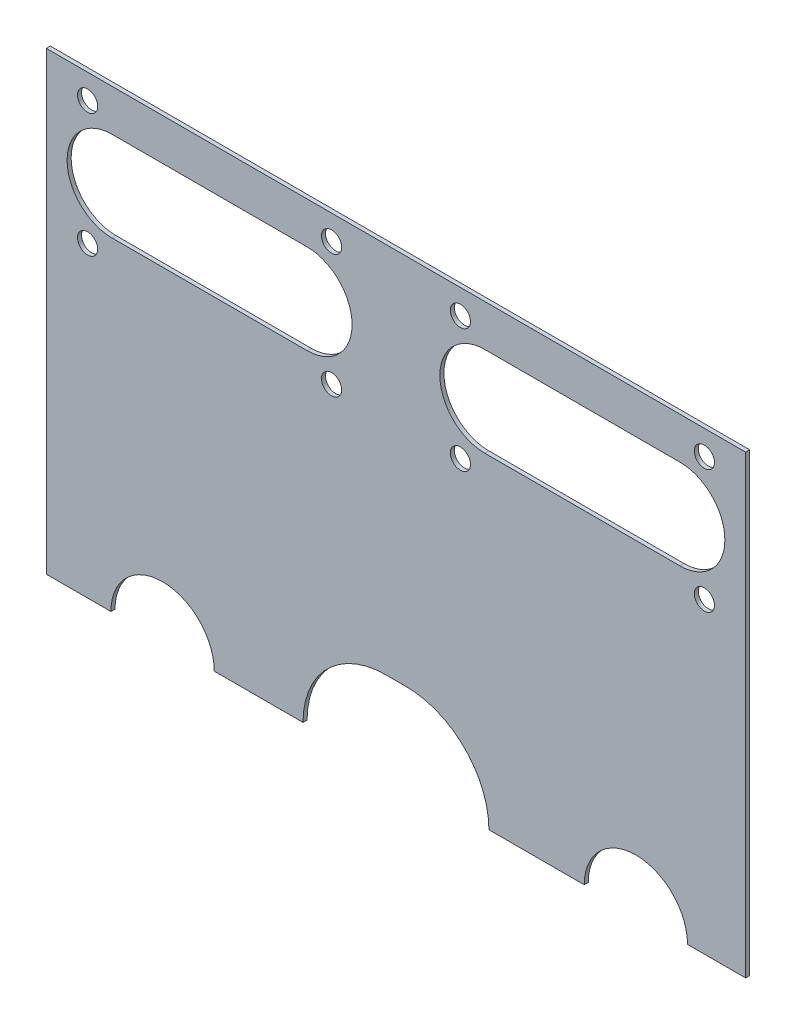
ISO-10303-21;
HEADER;
FILE_DESCRIPTION(('STEP AP214'),'2;1');
FILE_NAME('part.step','',(''),(''),'','','');
FILE_SCHEMA(('AUTOMOTIVE_DESIGN { 1 0 10303 214 1 1 1 1 }'));
ENDSEC;
DATA;
#1=APPLICATION_CONTEXT('core data for automotive mechanical design processes');
#2=APPLICATION_PROTOCOL_DEFINITION('international standard','automotive_design',2000,#1);
#3=PRODUCT_CONTEXT('',#1,'mechanical');
#4=PRODUCT('Part','Part','',(#3));
#5=PRODUCT_RELATED_PRODUCT_CATEGORY('part','',(#4));
#6=PRODUCT_DEFINITION_FORMATION('','',#4);
#7=PRODUCT_DEFINITION_CONTEXT('part definition',#1,'design');
#8=PRODUCT_DEFINITION('design','',#6,#7);
#9=PRODUCT_DEFINITION_SHAPE('','',#8);
#10=(LENGTH_UNIT() NAMED_UNIT(*) SI_UNIT(.MILLI.,.METRE.));
#11=(NAMED_UNIT(*) PLANE_ANGLE_UNIT() SI_UNIT($,.RADIAN.));
#12=(NAMED_UNIT(*) SI_UNIT($,.STERADIAN.) SOLID_ANGLE_UNIT());
#13=UNCERTAINTY_MEASURE_WITH_UNIT(LENGTH_MEASURE(1.E-05),#10,'distance_accuracy_value','');
#14=(GEOMETRIC_REPRESENTATION_CONTEXT(3) GLOBAL_UNCERTAINTY_ASSIGNED_CONTEXT((#13)) GLOBAL_UNIT_ASSIGNED_CONTEXT((#10,
#11,#12)) REPRESENTATION_CONTEXT('',''));
#15=CARTESIAN_POINT('',(0.,0.,0.));
#16=DIRECTION('',(0.,0.,1.));
#17=DIRECTION('',(1.,0.,0.));
#18=AXIS2_PLACEMENT_3D('',#15,#16,#17);
#19=CARTESIAN_POINT('',(0.,110.19565512848,-213.060100000002));
#20=DIRECTION('',(0.,0.,-1.));
#21=DIRECTION('',(0.,1.,0.));
#22=AXIS2_PLACEMENT_3D('',#19,#20,#21);
#23=PLANE('',#22);
#24=DIRECTION('',(0.,-1.,0.));
#25=VECTOR('',#24,1.);
#26=CARTESIAN_POINT('',(-107.499999999999,324.500355128482,-213.060100000001));
#27=LINE('',#26,#25);
#28=CARTESIAN_POINT('',(-107.499999999999,387.634255128482,-213.0601));
#29=VERTEX_POINT('',#28);
#30=CARTESIAN_POINT('',(-107.499999999999,247.639,-213.060100000001));
#31=VERTEX_POINT('',#30);
#32=EDGE_CURVE('E189',#29,#31,#27,.T.);
#33=ORIENTED_EDGE('',*,*,#32,.T.);
#34=DIRECTION('',(-1.,0.,0.));
#35=VECTOR('',#34,1.);
#36=CARTESIAN_POINT('',(-87.6224999999988,247.639,-213.060100000001));
#37=LINE('',#36,#35);
#38=CARTESIAN_POINT('',(-87.6224999999988,247.639,-213.060100000001));
#39=VERTEX_POINT('',#38);
#40=EDGE_CURVE('E393',#39,#31,#37,.T.);
#41=ORIENTED_EDGE('',*,*,#40,.F.);
#42=CARTESIAN_POINT('',(-71.7474999999988,247.639,-213.060100000001));
#43=DIRECTION('',(0.,0.,1.));
#44=DIRECTION('',(1.,0.,0.));
#45=AXIS2_PLACEMENT_3D('',#42,#43,#44);
#46=CIRCLE('',#45,15.875);
#47=CARTESIAN_POINT('',(-55.8724999999988,247.639,-213.060100000001));
#48=VERTEX_POINT('',#47);
#49=EDGE_CURVE('E398',#48,#39,#46,.T.);
#50=ORIENTED_EDGE('',*,*,#49,.F.);
#51=DIRECTION('',(-1.,0.,0.));
#52=VECTOR('',#51,1.);
#53=CARTESIAN_POINT('',(-28.5749999999993,247.639,-213.060100000001));
#54=LINE('',#53,#52);
#55=CARTESIAN_POINT('',(-28.5749999999993,247.639,-213.060100000001));
#56=VERTEX_POINT('',#55);
#57=EDGE_CURVE('E404',#56,#48,#54,.T.);
#58=ORIENTED_EDGE('',*,*,#57,.F.);
#59=CARTESIAN_POINT('',(-3.17499999999928,247.639,-213.060100000001));
#60=DIRECTION('',(0.,0.,1.));
#61=DIRECTION('',(-1.,0.,0.));
#62=AXIS2_PLACEMENT_3D('',#59,#60,#61);
#63=CIRCLE('',#62,25.4);
#64=CARTESIAN_POINT('',(-3.17499999999928,273.039,-213.060100000001));
#65=VERTEX_POINT('',#64);
#66=EDGE_CURVE('E409',#65,#56,#63,.T.);
#67=ORIENTED_EDGE('',*,*,#66,.F.);
#68=DIRECTION('',(-1.,0.,0.));
#69=VECTOR('',#68,1.);
#70=CARTESIAN_POINT('',(3.17500000000072,273.039,-213.060100000001));
#71=LINE('',#70,#69);
#72=CARTESIAN_POINT('',(3.17500000000072,273.039,-213.060100000001));
#73=VERTEX_POINT('',#72);
#74=EDGE_CURVE('E414',#73,#65,#71,.T.);
#75=ORIENTED_EDGE('',*,*,#74,.F.);
#76=CARTESIAN_POINT('',(3.17500000000072,247.639,-213.060100000001));
#77=DIRECTION('',(0.,0.,1.));
#78=DIRECTION('',(1.,0.,0.));
#79=AXIS2_PLACEMENT_3D('',#76,#77,#78);
#80=CIRCLE('',#79,25.4);
#81=CARTESIAN_POINT('',(28.5750000000007,247.639,-213.060100000001));
#82=VERTEX_POINT('',#81);
#83=EDGE_CURVE('E419',#82,#73,#80,.T.);
#84=ORIENTED_EDGE('',*,*,#83,.F.);
#85=DIRECTION('',(-1.,0.,0.));
#86=VECTOR('',#85,1.);
#87=CARTESIAN_POINT('',(57.877500000001,247.639,-213.0601));
#88=LINE('',#87,#86);
#89=CARTESIAN_POINT('',(57.877500000001,247.639,-213.0601));
#90=VERTEX_POINT('',#89);
#91=EDGE_CURVE('E424',#90,#82,#88,.T.);
#92=ORIENTED_EDGE('',*,*,#91,.F.);
#93=CARTESIAN_POINT('',(73.752500000001,247.639,-213.0601));
#94=DIRECTION('',(0.,0.,1.));
#95=DIRECTION('',(1.,0.,0.));
#96=AXIS2_PLACEMENT_3D('',#93,#94,#95);
#97=CIRCLE('',#96,15.875);
#98=CARTESIAN_POINT('',(89.627500000001,247.639,-213.0601));
#99=VERTEX_POINT('',#98);
#100=EDGE_CURVE('E203',#99,#90,#97,.T.);
#101=ORIENTED_EDGE('',*,*,#100,.F.);
#102=DIRECTION('',(-1.,0.,0.));
#103=VECTOR('',#102,1.);
#104=CARTESIAN_POINT('',(107.500000000001,247.639,-213.0601));
#105=LINE('',#104,#103);
#106=CARTESIAN_POINT('',(107.500000000001,247.639,-213.0601));
#107=VERTEX_POINT('',#106);
#108=EDGE_CURVE('E194',#107,#99,#105,.T.);
#109=ORIENTED_EDGE('',*,*,#108,.F.);
#110=DIRECTION('',(0.,1.,0.));
#111=VECTOR('',#110,1.);
#112=CARTESIAN_POINT('',(107.500000000001,387.634255128482,-213.0601));
#113=LINE('',#112,#111);
#114=CARTESIAN_POINT('',(107.500000000001,387.634255128482,-213.0601));
#115=VERTEX_POINT('',#114);
#116=EDGE_CURVE('E180',#107,#115,#113,.T.);
#117=ORIENTED_EDGE('',*,*,#116,.T.);
#118=DIRECTION('',(-1.,0.,0.));
#119=VECTOR('',#118,1.);
#120=CARTESIAN_POINT('',(-107.499999999999,387.634255128482,-213.0601));
#121=LINE('',#120,#119);
#122=EDGE_CURVE('E188',#115,#29,#121,.T.);
#123=ORIENTED_EDGE('',*,*,#122,.T.);
#124=EDGE_LOOP('',(#33,#41,#50,#58,#67,#75,#84,#92,#101,#109,#117,#123));
#125=FACE_BOUND('',#124,.T.);
#126=CARTESIAN_POINT('',(94.8000000000008,342.058755128482,-213.0601));
#127=DIRECTION('',(0.,0.,1.));
#128=DIRECTION('',(0.,-1.,0.));
#129=AXIS2_PLACEMENT_3D('',#126,#127,#128);
#130=CIRCLE('',#129,3.1);
#131=CARTESIAN_POINT('',(94.8000000000008,338.958755128482,-213.060100000001));
#132=VERTEX_POINT('',#131);
#133=EDGE_CURVE('E338',#132,#132,#130,.T.);
#134=ORIENTED_EDGE('',*,*,#133,.F.);
#135=EDGE_LOOP('',(#134));
#136=FACE_BOUND('',#135,.T.);
#137=CARTESIAN_POINT('',(19.8000000000008,342.058755128482,-213.0601));
#138=DIRECTION('',(0.,0.,1.));
#139=DIRECTION('',(0.,-1.,0.));
#140=AXIS2_PLACEMENT_3D('',#137,#138,#139);
#141=CIRCLE('',#140,3.09999999999998);
#142=CARTESIAN_POINT('',(19.8000000000008,338.958755128482,-213.0601));
#143=VERTEX_POINT('',#142);
#144=EDGE_CURVE('E331',#143,#143,#141,.T.);
#145=ORIENTED_EDGE('',*,*,#144,.F.);
#146=EDGE_LOOP('',(#145));
#147=FACE_BOUND('',#146,.T.);
#148=CARTESIAN_POINT('',(19.8000000000008,380.058755128482,-213.0601));
#149=DIRECTION('',(0.,0.,1.));
#150=DIRECTION('',(0.,-1.,0.));
#151=AXIS2_PLACEMENT_3D('',#148,#149,#150);
#152=CIRCLE('',#151,3.09999999999998);
#153=CARTESIAN_POINT('',(19.8000000000008,376.958755128482,-213.0601));
#154=VERTEX_POINT('',#153);
#155=EDGE_CURVE('E324',#154,#154,#152,.T.);
#156=ORIENTED_EDGE('',*,*,#155,.F.);
#157=EDGE_LOOP('',(#156));
#158=FACE_BOUND('',#157,.T.);
#159=CARTESIAN_POINT('',(94.8000000000008,380.058755128482,-213.0601));
#160=DIRECTION('',(0.,0.,1.));
#161=DIRECTION('',(0.,-1.,0.));
#162=AXIS2_PLACEMENT_3D('',#159,#160,#161);
#163=CIRCLE('',#162,3.1);
#164=CARTESIAN_POINT('',(94.8000000000008,376.958755128482,-213.0601));
#165=VERTEX_POINT('',#164);
#166=EDGE_CURVE('E317',#165,#165,#163,.T.);
#167=ORIENTED_EDGE('',*,*,#166,.F.);
#168=EDGE_LOOP('',(#167));
#169=FACE_BOUND('',#168,.T.);
#170=DIRECTION('',(-1.,0.,0.));
#171=VECTOR('',#170,1.);
#172=CARTESIAN_POINT('',(87.3000000000008,374.858755128482,-213.0601));
#173=LINE('',#172,#171);
#174=CARTESIAN_POINT('',(87.3000000000008,374.858755128482,-213.0601));
#175=VERTEX_POINT('',#174);
#176=CARTESIAN_POINT('',(27.3000000000008,374.858755128482,-213.0601));
#177=VERTEX_POINT('',#176);
#178=EDGE_CURVE('E288',#175,#177,#173,.T.);
#179=ORIENTED_EDGE('',*,*,#178,.F.);
#180=CARTESIAN_POINT('',(87.3000000000008,361.058755128482,-213.0601));
#181=DIRECTION('',(0.,0.,1.));
#182=DIRECTION('',(0.,-1.,0.));
#183=AXIS2_PLACEMENT_3D('',#180,#181,#182);
#184=CIRCLE('',#183,13.8);
#185=CARTESIAN_POINT('',(87.3000000000008,347.258755128482,-213.0601));
#186=VERTEX_POINT('',#185);
#187=EDGE_CURVE('E285',#186,#175,#184,.T.);
#188=ORIENTED_EDGE('',*,*,#187,.F.);
#189=DIRECTION('',(1.,0.,0.));
#190=VECTOR('',#189,1.);
#191=CARTESIAN_POINT('',(87.3000000000008,347.258755128482,-213.0601));
#192=LINE('',#191,#190);
#193=CARTESIAN_POINT('',(27.3000000000008,347.258755128482,-213.0601));
#194=VERTEX_POINT('',#193);
#195=EDGE_CURVE('E296',#194,#186,#192,.T.);
#196=ORIENTED_EDGE('',*,*,#195,.F.);
#197=CARTESIAN_POINT('',(27.3000000000008,361.058755128482,-213.0601));
#198=DIRECTION('',(0.,0.,1.));
#199=DIRECTION('',(0.,-1.,0.));
#200=AXIS2_PLACEMENT_3D('',#197,#198,#199);
#201=CIRCLE('',#200,13.8);
#202=EDGE_CURVE('E292',#177,#194,#201,.T.);
#203=ORIENTED_EDGE('',*,*,#202,.F.);
#204=EDGE_LOOP('',(#179,#188,#196,#203));
#205=FACE_BOUND('',#204,.T.);
#206=CARTESIAN_POINT('',(-94.8000000000008,342.058755128482,-213.0601));
#207=DIRECTION('',(0.,0.,-1.));
#208=DIRECTION('',(0.,-1.,0.));
#209=AXIS2_PLACEMENT_3D('',#206,#207,#208);
#210=CIRCLE('',#209,3.1);
#211=CARTESIAN_POINT('',(-94.8000000000008,338.958755128482,-213.0601));
#212=VERTEX_POINT('',#211);
#213=EDGE_CURVE('E267',#212,#212,#210,.T.);
#214=ORIENTED_EDGE('',*,*,#213,.T.);
#215=EDGE_LOOP('',(#214));
#216=FACE_BOUND('',#215,.T.);
#217=CARTESIAN_POINT('',(-19.8000000000008,342.058755128482,-213.0601));
#218=DIRECTION('',(0.,0.,-1.));
#219=DIRECTION('',(0.,-1.,0.));
#220=AXIS2_PLACEMENT_3D('',#217,#218,#219);
#221=CIRCLE('',#220,3.09999999999998);
#222=CARTESIAN_POINT('',(-19.8000000000008,338.958755128482,-213.060100000001));
#223=VERTEX_POINT('',#222);
#224=EDGE_CURVE('E260',#223,#223,#221,.T.);
#225=ORIENTED_EDGE('',*,*,#224,.T.);
#226=EDGE_LOOP('',(#225));
#227=FACE_BOUND('',#226,.T.);
#228=CARTESIAN_POINT('',(-19.8000000000008,380.058755128482,-213.0601));
#229=DIRECTION('',(0.,0.,-1.));
#230=DIRECTION('',(0.,-1.,0.));
#231=AXIS2_PLACEMENT_3D('',#228,#229,#230);
#232=CIRCLE('',#231,3.09999999999998);
#233=CARTESIAN_POINT('',(-19.8000000000008,376.958755128482,-213.0601));
#234=VERTEX_POINT('',#233);
#235=EDGE_CURVE('E253',#234,#234,#232,.T.);
#236=ORIENTED_EDGE('',*,*,#235,.T.);
#237=EDGE_LOOP('',(#236));
#238=FACE_BOUND('',#237,.T.);
#239=CARTESIAN_POINT('',(-94.8000000000008,380.058755128482,-213.0601));
#240=DIRECTION('',(0.,0.,-1.));
#241=DIRECTION('',(0.,-1.,0.));
#242=AXIS2_PLACEMENT_3D('',#239,#240,#241);
#243=CIRCLE('',#242,3.1);
#244=CARTESIAN_POINT('',(-94.8000000000008,376.958755128482,-213.0601));
#245=VERTEX_POINT('',#244);
#246=EDGE_CURVE('E245',#245,#245,#243,.T.);
#247=ORIENTED_EDGE('',*,*,#246,.T.);
#248=EDGE_LOOP('',(#247));
#249=FACE_BOUND('',#248,.T.);
#250=CARTESIAN_POINT('',(-87.3000000000008,361.058755128482,-213.0601));
#251=DIRECTION('',(0.,0.,-1.));
#252=DIRECTION('',(0.,-1.,0.));
#253=AXIS2_PLACEMENT_3D('',#250,#251,#252);
#254=CIRCLE('',#253,13.8);
#255=CARTESIAN_POINT('',(-87.3000000000008,347.258755128482,-213.060100000001));
#256=VERTEX_POINT('',#255);
#257=CARTESIAN_POINT('',(-87.3000000000008,374.858755128482,-213.0601));
#258=VERTEX_POINT('',#257);
#259=EDGE_CURVE('E58',#256,#258,#254,.T.);
#260=ORIENTED_EDGE('',*,*,#259,.T.);
#261=DIRECTION('',(1.,0.,0.));
#262=VECTOR('',#261,1.);
#263=CARTESIAN_POINT('',(-87.3000000000008,374.858755128482,-213.0601));
#264=LINE('',#263,#262);
#265=CARTESIAN_POINT('',(-27.3000000000008,374.858755128482,-213.0601));
#266=VERTEX_POINT('',#265);
#267=EDGE_CURVE('E227',#258,#266,#264,.T.);
#268=ORIENTED_EDGE('',*,*,#267,.T.);
#269=CARTESIAN_POINT('',(-27.3000000000008,361.058755128482,-213.0601));
#270=DIRECTION('',(0.,0.,-1.));
#271=DIRECTION('',(0.,-1.,0.));
#272=AXIS2_PLACEMENT_3D('',#269,#270,#271);
#273=CIRCLE('',#272,13.8);
#274=CARTESIAN_POINT('',(-27.3000000000008,347.258755128482,-213.0601));
#275=VERTEX_POINT('',#274);
#276=EDGE_CURVE('E223',#266,#275,#273,.T.);
#277=ORIENTED_EDGE('',*,*,#276,.T.);
#278=DIRECTION('',(-1.,0.,0.));
#279=VECTOR('',#278,1.);
#280=CARTESIAN_POINT('',(-87.3000000000008,347.258755128482,-213.0601));
#281=LINE('',#280,#279);
#282=EDGE_CURVE('E220',#275,#256,#281,.T.);
#283=ORIENTED_EDGE('',*,*,#282,.T.);
#284=EDGE_LOOP('',(#260,#268,#277,#283));
#285=FACE_BOUND('',#284,.T.);
#286=ADVANCED_FACE('F43',(#125,#136,#147,#158,#169,#205,#216,#227,#238,#249,#285),#23,.F.);
#287=CARTESIAN_POINT('',(-71.7474999999988,247.639,-214.304700000001));
#288=DIRECTION('',(0.,0.,1.));
#289=DIRECTION('',(1.,0.,0.));
#290=AXIS2_PLACEMENT_3D('',#287,#288,#289);
#291=PLANE('',#290);
#292=CARTESIAN_POINT('',(-94.8000000000008,380.058755128482,-214.3047));
#293=DIRECTION('',(0.,0.,-1.));
#294=DIRECTION('',(0.,1.,0.));
#295=AXIS2_PLACEMENT_3D('',#292,#293,#294);
#296=CIRCLE('',#295,3.1);
#297=CARTESIAN_POINT('',(-94.8000000000008,383.158755128482,-214.3047));
#298=VERTEX_POINT('',#297);
#299=EDGE_CURVE('E249',#298,#298,#296,.T.);
#300=ORIENTED_EDGE('',*,*,#299,.F.);
#301=EDGE_LOOP('',(#300));
#302=FACE_BOUND('',#301,.T.);
#303=CARTESIAN_POINT('',(-19.8000000000008,380.058755128482,-214.3047));
#304=DIRECTION('',(0.,0.,-1.));
#305=DIRECTION('',(0.,1.,0.));
#306=AXIS2_PLACEMENT_3D('',#303,#304,#305);
#307=CIRCLE('',#306,3.09999999999998);
#308=CARTESIAN_POINT('',(-19.8000000000008,383.158755128482,-214.3047));
#309=VERTEX_POINT('',#308);
#310=EDGE_CURVE('E257',#309,#309,#307,.T.);
#311=ORIENTED_EDGE('',*,*,#310,.F.);
#312=EDGE_LOOP('',(#311));
#313=FACE_BOUND('',#312,.T.);
#314=CARTESIAN_POINT('',(-19.8000000000008,342.058755128482,-214.304700000001));
#315=DIRECTION('',(0.,0.,-1.));
#316=DIRECTION('',(0.,1.,0.));
#317=AXIS2_PLACEMENT_3D('',#314,#315,#316);
#318=CIRCLE('',#317,3.09999999999998);
#319=CARTESIAN_POINT('',(-19.8000000000008,345.158755128482,-214.304700000001));
#320=VERTEX_POINT('',#319);
#321=EDGE_CURVE('E264',#320,#320,#318,.T.);
#322=ORIENTED_EDGE('',*,*,#321,.F.);
#323=EDGE_LOOP('',(#322));
#324=FACE_BOUND('',#323,.T.);
#325=CARTESIAN_POINT('',(-94.8000000000008,342.058755128482,-214.304700000001));
#326=DIRECTION('',(0.,0.,-1.));
#327=DIRECTION('',(0.,1.,0.));
#328=AXIS2_PLACEMENT_3D('',#325,#326,#327);
#329=CIRCLE('',#328,3.1);
#330=CARTESIAN_POINT('',(-94.8000000000008,345.158755128482,-214.3047));
#331=VERTEX_POINT('',#330);
#332=EDGE_CURVE('E271',#331,#331,#329,.T.);
#333=ORIENTED_EDGE('',*,*,#332,.F.);
#334=EDGE_LOOP('',(#333));
#335=FACE_BOUND('',#334,.T.);
#336=CARTESIAN_POINT('',(87.3000000000008,361.058755128482,-214.3047));
#337=DIRECTION('',(0.,0.,-1.));
#338=DIRECTION('',(0.,1.,0.));
#339=AXIS2_PLACEMENT_3D('',#336,#337,#338);
#340=CIRCLE('',#339,13.8);
#341=CARTESIAN_POINT('',(87.3000000000008,347.258755128482,-214.304700000001));
#342=VERTEX_POINT('',#341);
#343=CARTESIAN_POINT('',(87.3000000000008,374.858755128482,-214.3047));
#344=VERTEX_POINT('',#343);
#345=EDGE_CURVE('E281',#342,#344,#340,.F.);
#346=ORIENTED_EDGE('',*,*,#345,.T.);
#347=DIRECTION('',(-1.,0.,0.));
#348=VECTOR('',#347,1.);
#349=CARTESIAN_POINT('',(87.3000000000008,374.858755128482,-214.3047));
#350=LINE('',#349,#348);
#351=CARTESIAN_POINT('',(27.3000000000008,374.858755128482,-214.3047));
#352=VERTEX_POINT('',#351);
#353=EDGE_CURVE('E304',#344,#352,#350,.T.);
#354=ORIENTED_EDGE('',*,*,#353,.T.);
#355=CARTESIAN_POINT('',(27.3000000000008,361.058755128482,-214.3047));
#356=DIRECTION('',(0.,0.,-1.));
#357=DIRECTION('',(0.,1.,0.));
#358=AXIS2_PLACEMENT_3D('',#355,#356,#357);
#359=CIRCLE('',#358,13.8);
#360=CARTESIAN_POINT('',(27.3000000000008,347.258755128482,-214.304700000001));
#361=VERTEX_POINT('',#360);
#362=EDGE_CURVE('E274',#352,#361,#359,.F.);
#363=ORIENTED_EDGE('',*,*,#362,.T.);
#364=DIRECTION('',(1.,0.,0.));
#365=VECTOR('',#364,1.);
#366=CARTESIAN_POINT('',(87.3000000000008,347.258755128482,-214.304700000001));
#367=LINE('',#366,#365);
#368=EDGE_CURVE('E278',#361,#342,#367,.T.);
#369=ORIENTED_EDGE('',*,*,#368,.T.);
#370=EDGE_LOOP('',(#346,#354,#363,#369));
#371=FACE_BOUND('',#370,.T.);
#372=CARTESIAN_POINT('',(94.8000000000008,380.058755128482,-214.3047));
#373=DIRECTION('',(0.,0.,-1.));
#374=DIRECTION('',(0.,1.,0.));
#375=AXIS2_PLACEMENT_3D('',#372,#373,#374);
#376=CIRCLE('',#375,3.1);
#377=CARTESIAN_POINT('',(94.8000000000008,383.158755128482,-214.3047));
#378=VERTEX_POINT('',#377);
#379=EDGE_CURVE('E316',#378,#378,#376,.F.);
#380=ORIENTED_EDGE('',*,*,#379,.T.);
#381=EDGE_LOOP('',(#380));
#382=FACE_BOUND('',#381,.T.);
#383=CARTESIAN_POINT('',(19.8000000000008,380.058755128482,-214.3047));
#384=DIRECTION('',(0.,0.,-1.));
#385=DIRECTION('',(0.,1.,0.));
#386=AXIS2_PLACEMENT_3D('',#383,#384,#385);
#387=CIRCLE('',#386,3.09999999999998);
#388=CARTESIAN_POINT('',(19.8000000000008,383.158755128482,-214.3047));
#389=VERTEX_POINT('',#388);
#390=EDGE_CURVE('E321',#389,#389,#387,.F.);
#391=ORIENTED_EDGE('',*,*,#390,.T.);
#392=EDGE_LOOP('',(#391));
#393=FACE_BOUND('',#392,.T.);
#394=CARTESIAN_POINT('',(19.8000000000008,342.058755128482,-214.304700000001));
#395=DIRECTION('',(0.,0.,-1.));
#396=DIRECTION('',(0.,1.,0.));
#397=AXIS2_PLACEMENT_3D('',#394,#395,#396);
#398=CIRCLE('',#397,3.09999999999998);
#399=CARTESIAN_POINT('',(19.8000000000008,345.158755128482,-214.3047));
#400=VERTEX_POINT('',#399);
#401=EDGE_CURVE('E328',#400,#400,#398,.F.);
#402=ORIENTED_EDGE('',*,*,#401,.T.);
#403=EDGE_LOOP('',(#402));
#404=FACE_BOUND('',#403,.T.);
#405=CARTESIAN_POINT('',(94.8000000000008,342.058755128482,-214.304700000001));
#406=DIRECTION('',(0.,0.,-1.));
#407=DIRECTION('',(0.,1.,0.));
#408=AXIS2_PLACEMENT_3D('',#405,#406,#407);
#409=CIRCLE('',#408,3.1);
#410=CARTESIAN_POINT('',(94.8000000000008,345.158755128482,-214.304700000001));
#411=VERTEX_POINT('',#410);
#412=EDGE_CURVE('E335',#411,#411,#409,.F.);
#413=ORIENTED_EDGE('',*,*,#412,.T.);
#414=EDGE_LOOP('',(#413));
#415=FACE_BOUND('',#414,.T.);
#416=DIRECTION('',(0.,1.,0.));
#417=VECTOR('',#416,1.);
#418=CARTESIAN_POINT('',(107.500000000001,387.634255128482,-214.3047));
#419=LINE('',#418,#417);
#420=CARTESIAN_POINT('',(107.500000000001,247.639,-214.3047));
#421=VERTEX_POINT('',#420);
#422=CARTESIAN_POINT('',(107.500000000001,387.634255128482,-214.3047));
#423=VERTEX_POINT('',#422);
#424=EDGE_CURVE('E349',#421,#423,#419,.T.);
#425=ORIENTED_EDGE('',*,*,#424,.F.);
#426=DIRECTION('',(-1.,0.,0.));
#427=VECTOR('',#426,1.);
#428=CARTESIAN_POINT('',(107.500000000001,247.639,-214.3047));
#429=LINE('',#428,#427);
#430=CARTESIAN_POINT('',(89.627500000001,247.639,-214.3047));
#431=VERTEX_POINT('',#430);
#432=EDGE_CURVE('E196',#421,#431,#429,.T.);
#433=ORIENTED_EDGE('',*,*,#432,.T.);
#434=CARTESIAN_POINT('',(73.752500000001,247.639,-214.3047));
#435=DIRECTION('',(0.,0.,1.));
#436=DIRECTION('',(1.,0.,0.));
#437=AXIS2_PLACEMENT_3D('',#434,#435,#436);
#438=CIRCLE('',#437,15.875);
#439=CARTESIAN_POINT('',(57.877500000001,247.639,-214.3047));
#440=VERTEX_POINT('',#439);
#441=EDGE_CURVE('E387',#431,#440,#438,.T.);
#442=ORIENTED_EDGE('',*,*,#441,.T.);
#443=DIRECTION('',(-1.,0.,0.));
#444=VECTOR('',#443,1.);
#445=CARTESIAN_POINT('',(57.877500000001,247.639,-214.3047));
#446=LINE('',#445,#444);
#447=CARTESIAN_POINT('',(28.5750000000007,247.639,-214.304700000001));
#448=VERTEX_POINT('',#447);
#449=EDGE_CURVE('E384',#440,#448,#446,.T.);
#450=ORIENTED_EDGE('',*,*,#449,.T.);
#451=CARTESIAN_POINT('',(3.17500000000072,247.639,-214.304700000001));
#452=DIRECTION('',(0.,0.,1.));
#453=DIRECTION('',(1.,0.,0.));
#454=AXIS2_PLACEMENT_3D('',#451,#452,#453);
#455=CIRCLE('',#454,25.4);
#456=CARTESIAN_POINT('',(3.17500000000072,273.039,-214.304700000001));
#457=VERTEX_POINT('',#456);
#458=EDGE_CURVE('E381',#448,#457,#455,.T.);
#459=ORIENTED_EDGE('',*,*,#458,.T.);
#460=DIRECTION('',(-1.,0.,0.));
#461=VECTOR('',#460,1.);
#462=CARTESIAN_POINT('',(3.17500000000072,273.039,-214.304700000001));
#463=LINE('',#462,#461);
#464=CARTESIAN_POINT('',(-3.17499999999928,273.039,-214.304700000001));
#465=VERTEX_POINT('',#464);
#466=EDGE_CURVE('E378',#457,#465,#463,.T.);
#467=ORIENTED_EDGE('',*,*,#466,.T.);
#468=CARTESIAN_POINT('',(-3.17499999999928,247.639,-214.304700000001));
#469=DIRECTION('',(0.,0.,1.));
#470=DIRECTION('',(-1.,0.,0.));
#471=AXIS2_PLACEMENT_3D('',#468,#469,#470);
#472=CIRCLE('',#471,25.4);
#473=CARTESIAN_POINT('',(-28.5749999999993,247.639,-214.304700000001));
#474=VERTEX_POINT('',#473);
#475=EDGE_CURVE('E375',#465,#474,#472,.T.);
#476=ORIENTED_EDGE('',*,*,#475,.T.);
#477=DIRECTION('',(-1.,0.,0.));
#478=VECTOR('',#477,1.);
#479=CARTESIAN_POINT('',(-28.5749999999993,247.639,-214.304700000001));
#480=LINE('',#479,#478);
#481=CARTESIAN_POINT('',(-55.8724999999988,247.639,-214.304700000001));
#482=VERTEX_POINT('',#481);
#483=EDGE_CURVE('E371',#474,#482,#480,.T.);
#484=ORIENTED_EDGE('',*,*,#483,.T.);
#485=CARTESIAN_POINT('',(-71.7474999999988,247.639,-214.304700000001));
#486=DIRECTION('',(0.,0.,1.));
#487=DIRECTION('',(1.,0.,0.));
#488=AXIS2_PLACEMENT_3D('',#485,#486,#487);
#489=CIRCLE('',#488,15.875);
#490=CARTESIAN_POINT('',(-87.6224999999988,247.639,-214.304700000001));
#491=VERTEX_POINT('',#490);
#492=EDGE_CURVE('E368',#482,#491,#489,.T.);
#493=ORIENTED_EDGE('',*,*,#492,.T.);
#494=DIRECTION('',(-1.,0.,0.));
#495=VECTOR('',#494,1.);
#496=CARTESIAN_POINT('',(-87.6224999999988,247.639,-214.304700000001));
#497=LINE('',#496,#495);
#498=CARTESIAN_POINT('',(-107.499999999999,247.639,-214.304700000001));
#499=VERTEX_POINT('',#498);
#500=EDGE_CURVE('E197',#491,#499,#497,.T.);
#501=ORIENTED_EDGE('',*,*,#500,.T.);
#502=DIRECTION('',(0.,-1.,0.));
#503=VECTOR('',#502,1.);
#504=CARTESIAN_POINT('',(-107.499999999999,324.500355128482,-214.304700000001));
#505=LINE('',#504,#503);
#506=CARTESIAN_POINT('',(-107.499999999999,387.634255128482,-214.3047));
#507=VERTEX_POINT('',#506);
#508=EDGE_CURVE('E342',#507,#499,#505,.T.);
#509=ORIENTED_EDGE('',*,*,#508,.F.);
#510=DIRECTION('',(-1.,0.,0.));
#511=VECTOR('',#510,1.);
#512=CARTESIAN_POINT('',(-107.499999999999,387.634255128482,-214.3047));
#513=LINE('',#512,#511);
#514=EDGE_CURVE('E345',#423,#507,#513,.T.);
#515=ORIENTED_EDGE('',*,*,#514,.F.);
#516=EDGE_LOOP('',(#425,#433,#442,#450,#459,#467,#476,#484,#493,#501,#509,#515));
#517=FACE_BOUND('',#516,.T.);
#518=DIRECTION('',(1.,0.,0.));
#519=VECTOR('',#518,1.);
#520=CARTESIAN_POINT('',(-87.3000000000008,374.858755128482,-214.3047));
#521=LINE('',#520,#519);
#522=CARTESIAN_POINT('',(-87.3000000000008,374.858755128482,-214.3047));
#523=VERTEX_POINT('',#522);
#524=CARTESIAN_POINT('',(-27.3000000000008,374.858755128482,-214.3047));
#525=VERTEX_POINT('',#524);
#526=EDGE_CURVE('E211',#523,#525,#521,.T.);
#527=ORIENTED_EDGE('',*,*,#526,.F.);
#528=CARTESIAN_POINT('',(-87.3000000000008,361.058755128482,-214.3047));
#529=DIRECTION('',(0.,0.,-1.));
#530=DIRECTION('',(0.,1.,0.));
#531=AXIS2_PLACEMENT_3D('',#528,#529,#530);
#532=CIRCLE('',#531,13.8);
#533=CARTESIAN_POINT('',(-87.3000000000008,347.258755128482,-214.304700000001));
#534=VERTEX_POINT('',#533);
#535=EDGE_CURVE('E214',#534,#523,#532,.T.);
#536=ORIENTED_EDGE('',*,*,#535,.F.);
#537=DIRECTION('',(-1.,0.,0.));
#538=VECTOR('',#537,1.);
#539=CARTESIAN_POINT('',(-87.3000000000008,347.258755128482,-214.304700000001));
#540=LINE('',#539,#538);
#541=CARTESIAN_POINT('',(-27.3000000000008,347.258755128482,-214.304700000001));
#542=VERTEX_POINT('',#541);
#543=EDGE_CURVE('E234',#542,#534,#540,.T.);
#544=ORIENTED_EDGE('',*,*,#543,.F.);
#545=CARTESIAN_POINT('',(-27.3000000000008,361.058755128482,-214.3047));
#546=DIRECTION('',(0.,0.,-1.));
#547=DIRECTION('',(0.,1.,0.));
#548=AXIS2_PLACEMENT_3D('',#545,#546,#547);
#549=CIRCLE('',#548,13.8);
#550=EDGE_CURVE('E66',#525,#542,#549,.T.);
#551=ORIENTED_EDGE('',*,*,#550,.F.);
#552=EDGE_LOOP('',(#527,#536,#544,#551));
#553=FACE_BOUND('',#552,.T.);
#554=ADVANCED_FACE('F45',(#302,#313,#324,#335,#371,#382,#393,#404,#415,#517,#553),#291,.F.);
#555=CARTESIAN_POINT('',(-107.499999999999,324.500355128482,-213.060100000001));
#556=DIRECTION('',(1.,0.,0.));
#557=DIRECTION('',(0.,1.,0.));
#558=AXIS2_PLACEMENT_3D('',#555,#556,#557);
#559=PLANE('',#558);
#560=ORIENTED_EDGE('',*,*,#508,.T.);
#561=DIRECTION('',(0.,0.,-1.));
#562=VECTOR('',#561,1.);
#563=CARTESIAN_POINT('',(-107.499999999999,247.639,-213.060100000001));
#564=LINE('',#563,#562);
#565=EDGE_CURVE('E391',#31,#499,#564,.T.);
#566=ORIENTED_EDGE('',*,*,#565,.F.);
#567=ORIENTED_EDGE('',*,*,#32,.F.);
#568=DIRECTION('',(0.,0.,-1.));
#569=VECTOR('',#568,1.);
#570=CARTESIAN_POINT('',(-107.499999999999,387.634255128482,-213.0601));
#571=LINE('',#570,#569);
#572=EDGE_CURVE('E51',#29,#507,#571,.T.);
#573=ORIENTED_EDGE('',*,*,#572,.T.);
#574=EDGE_LOOP('',(#560,#566,#567,#573));
#575=FACE_BOUND('',#574,.T.);
#576=ADVANCED_FACE('F356',(#575),#559,.F.);
#577=CARTESIAN_POINT('',(107.500000000001,387.634255128482,-213.0601));
#578=DIRECTION('',(-1.,0.,0.));
#579=DIRECTION('',(0.,-1.,0.));
#580=AXIS2_PLACEMENT_3D('',#577,#578,#579);
#581=PLANE('',#580);
#582=ORIENTED_EDGE('',*,*,#116,.F.);
#583=DIRECTION('',(0.,0.,-1.));
#584=VECTOR('',#583,1.);
#585=CARTESIAN_POINT('',(107.500000000001,247.639,-213.0601));
#586=LINE('',#585,#584);
#587=EDGE_CURVE('E183',#107,#421,#586,.T.);
#588=ORIENTED_EDGE('',*,*,#587,.T.);
#589=ORIENTED_EDGE('',*,*,#424,.T.);
#590=DIRECTION('',(0.,0.,-1.));
#591=VECTOR('',#590,1.);
#592=CARTESIAN_POINT('',(107.500000000001,387.634255128482,-213.0601));
#593=LINE('',#592,#591);
#594=EDGE_CURVE('E11',#115,#423,#593,.T.);
#595=ORIENTED_EDGE('',*,*,#594,.F.);
#596=EDGE_LOOP('',(#582,#588,#589,#595));
#597=FACE_BOUND('',#596,.T.);
#598=ADVANCED_FACE('F182',(#597),#581,.F.);
#599=CARTESIAN_POINT('',(-107.499999999999,387.634255128482,-213.0601));
#600=DIRECTION('',(0.,-1.,0.));
#601=DIRECTION('',(0.,0.,-1.));
#602=AXIS2_PLACEMENT_3D('',#599,#600,#601);
#603=PLANE('',#602);
#604=ORIENTED_EDGE('',*,*,#514,.T.);
#605=ORIENTED_EDGE('',*,*,#572,.F.);
#606=ORIENTED_EDGE('',*,*,#122,.F.);
#607=ORIENTED_EDGE('',*,*,#594,.T.);
#608=EDGE_LOOP('',(#604,#605,#606,#607));
#609=FACE_BOUND('',#608,.T.);
#610=ADVANCED_FACE('F432',(#609),#603,.F.);
#611=CARTESIAN_POINT('',(94.8000000000008,342.058755128485,-551.696700000001));
#612=DIRECTION('',(0.,0.,1.));
#613=DIRECTION('',(0.,-1.,0.));
#614=AXIS2_PLACEMENT_3D('',#611,#612,#613);
#615=CYLINDRICAL_SURFACE('',#614,3.1);
#616=ORIENTED_EDGE('',*,*,#412,.F.);
#617=EDGE_LOOP('',(#616));
#618=FACE_BOUND('',#617,.T.);
#619=ORIENTED_EDGE('',*,*,#133,.T.);
#620=EDGE_LOOP('',(#619));
#621=FACE_BOUND('',#620,.T.);
#622=ADVANCED_FACE('F472',(#618,#621),#615,.F.);
#623=CARTESIAN_POINT('',(19.8000000000008,342.058755128485,-551.696700000001));
#624=DIRECTION('',(0.,0.,1.));
#625=DIRECTION('',(0.,-1.,0.));
#626=AXIS2_PLACEMENT_3D('',#623,#624,#625);
#627=CYLINDRICAL_SURFACE('',#626,3.09999999999998);
#628=ORIENTED_EDGE('',*,*,#401,.F.);
#629=EDGE_LOOP('',(#628));
#630=FACE_BOUND('',#629,.T.);
#631=ORIENTED_EDGE('',*,*,#144,.T.);
#632=EDGE_LOOP('',(#631));
#633=FACE_BOUND('',#632,.T.);
#634=ADVANCED_FACE('F500',(#630,#633),#627,.F.);
#635=CARTESIAN_POINT('',(19.8000000000008,380.058755128485,-551.696700000001));
#636=DIRECTION('',(0.,0.,1.));
#637=DIRECTION('',(0.,-1.,0.));
#638=AXIS2_PLACEMENT_3D('',#635,#636,#637);
#639=CYLINDRICAL_SURFACE('',#638,3.09999999999998);
#640=ORIENTED_EDGE('',*,*,#390,.F.);
#641=EDGE_LOOP('',(#640));
#642=FACE_BOUND('',#641,.T.);
#643=ORIENTED_EDGE('',*,*,#155,.T.);
#644=EDGE_LOOP('',(#643));
#645=FACE_BOUND('',#644,.T.);
#646=ADVANCED_FACE('F508',(#642,#645),#639,.F.);
#647=CARTESIAN_POINT('',(94.8000000000008,380.058755128485,-551.696700000001));
#648=DIRECTION('',(0.,0.,1.));
#649=DIRECTION('',(0.,-1.,0.));
#650=AXIS2_PLACEMENT_3D('',#647,#648,#649);
#651=CYLINDRICAL_SURFACE('',#650,3.1);
#652=ORIENTED_EDGE('',*,*,#379,.F.);
#653=EDGE_LOOP('',(#652));
#654=FACE_BOUND('',#653,.T.);
#655=ORIENTED_EDGE('',*,*,#166,.T.);
#656=EDGE_LOOP('',(#655));
#657=FACE_BOUND('',#656,.T.);
#658=ADVANCED_FACE('F516',(#654,#657),#651,.F.);
#659=CARTESIAN_POINT('',(87.3000000000008,361.058755128485,-551.696700000001));
#660=DIRECTION('',(0.,0.,1.));
#661=DIRECTION('',(0.,-1.,0.));
#662=AXIS2_PLACEMENT_3D('',#659,#660,#661);
#663=CYLINDRICAL_SURFACE('',#662,13.8);
#664=DIRECTION('',(0.,0.,1.));
#665=VECTOR('',#664,1.);
#666=CARTESIAN_POINT('',(87.3000000000008,347.258755128485,-551.696700000001));
#667=LINE('',#666,#665);
#668=EDGE_CURVE('E301',#342,#186,#667,.T.);
#669=ORIENTED_EDGE('',*,*,#668,.T.);
#670=ORIENTED_EDGE('',*,*,#187,.T.);
#671=DIRECTION('',(0.,0.,1.));
#672=VECTOR('',#671,1.);
#673=CARTESIAN_POINT('',(87.3000000000008,374.858755128485,-551.696700000001));
#674=LINE('',#673,#672);
#675=EDGE_CURVE('E300',#344,#175,#674,.T.);
#676=ORIENTED_EDGE('',*,*,#675,.F.);
#677=ORIENTED_EDGE('',*,*,#345,.F.);
#678=EDGE_LOOP('',(#669,#670,#676,#677));
#679=FACE_BOUND('',#678,.T.);
#680=ADVANCED_FACE('F525',(#679),#663,.F.);
#681=CARTESIAN_POINT('',(87.3000000000008,347.258755128485,-551.696700000001));
#682=DIRECTION('',(0.,-1.,0.));
#683=DIRECTION('',(0.,0.,-1.));
#684=AXIS2_PLACEMENT_3D('',#681,#682,#683);
#685=PLANE('',#684);
#686=DIRECTION('',(0.,0.,1.));
#687=VECTOR('',#686,1.);
#688=CARTESIAN_POINT('',(27.3000000000008,347.258755128485,-551.696700000001));
#689=LINE('',#688,#687);
#690=EDGE_CURVE('E305',#361,#194,#689,.T.);
#691=ORIENTED_EDGE('',*,*,#690,.T.);
#692=ORIENTED_EDGE('',*,*,#195,.T.);
#693=ORIENTED_EDGE('',*,*,#668,.F.);
#694=ORIENTED_EDGE('',*,*,#368,.F.);
#695=EDGE_LOOP('',(#691,#692,#693,#694));
#696=FACE_BOUND('',#695,.T.);
#697=ADVANCED_FACE('F535',(#696),#685,.F.);
#698=CARTESIAN_POINT('',(27.3000000000008,361.058755128485,-551.696700000001));
#699=DIRECTION('',(0.,0.,1.));
#700=DIRECTION('',(0.,-1.,0.));
#701=AXIS2_PLACEMENT_3D('',#698,#699,#700);
#702=CYLINDRICAL_SURFACE('',#701,13.8);
#703=DIRECTION('',(0.,0.,1.));
#704=VECTOR('',#703,1.);
#705=CARTESIAN_POINT('',(27.3000000000008,374.858755128485,-551.696700000001));
#706=LINE('',#705,#704);
#707=EDGE_CURVE('E308',#352,#177,#706,.T.);
#708=ORIENTED_EDGE('',*,*,#707,.T.);
#709=ORIENTED_EDGE('',*,*,#202,.T.);
#710=ORIENTED_EDGE('',*,*,#690,.F.);
#711=ORIENTED_EDGE('',*,*,#362,.F.);
#712=EDGE_LOOP('',(#708,#709,#710,#711));
#713=FACE_BOUND('',#712,.T.);
#714=ADVANCED_FACE('F543',(#713),#702,.F.);
#715=CARTESIAN_POINT('',(87.3000000000008,374.858755128485,-551.696700000001));
#716=DIRECTION('',(0.,1.,0.));
#717=DIRECTION('',(0.,0.,1.));
#718=AXIS2_PLACEMENT_3D('',#715,#716,#717);
#719=PLANE('',#718);
#720=ORIENTED_EDGE('',*,*,#675,.T.);
#721=ORIENTED_EDGE('',*,*,#178,.T.);
#722=ORIENTED_EDGE('',*,*,#707,.F.);
#723=ORIENTED_EDGE('',*,*,#353,.F.);
#724=EDGE_LOOP('',(#720,#721,#722,#723));
#725=FACE_BOUND('',#724,.T.);
#726=ADVANCED_FACE('F552',(#725),#719,.F.);
#727=CARTESIAN_POINT('',(-94.8000000000008,342.058755128483,-290.505700000001));
#728=DIRECTION('',(0.,0.,1.));
#729=DIRECTION('',(0.,-1.,0.));
#730=AXIS2_PLACEMENT_3D('',#727,#728,#729);
#731=CYLINDRICAL_SURFACE('',#730,3.1);
#732=ORIENTED_EDGE('',*,*,#332,.T.);
#733=EDGE_LOOP('',(#732));
#734=FACE_BOUND('',#733,.T.);
#735=ORIENTED_EDGE('',*,*,#213,.F.);
#736=EDGE_LOOP('',(#735));
#737=FACE_BOUND('',#736,.T.);
#738=ADVANCED_FACE('F560',(#734,#737),#731,.F.);
#739=CARTESIAN_POINT('',(-19.8000000000008,342.058755128483,-290.505700000001));
#740=DIRECTION('',(0.,0.,1.));
#741=DIRECTION('',(0.,-1.,0.));
#742=AXIS2_PLACEMENT_3D('',#739,#740,#741);
#743=CYLINDRICAL_SURFACE('',#742,3.09999999999998);
#744=ORIENTED_EDGE('',*,*,#321,.T.);
#745=EDGE_LOOP('',(#744));
#746=FACE_BOUND('',#745,.T.);
#747=ORIENTED_EDGE('',*,*,#224,.F.);
#748=EDGE_LOOP('',(#747));
#749=FACE_BOUND('',#748,.T.);
#750=ADVANCED_FACE('F568',(#746,#749),#743,.F.);
#751=CARTESIAN_POINT('',(-19.8000000000008,380.058755128483,-290.505700000001));
#752=DIRECTION('',(0.,0.,1.));
#753=DIRECTION('',(0.,-1.,0.));
#754=AXIS2_PLACEMENT_3D('',#751,#752,#753);
#755=CYLINDRICAL_SURFACE('',#754,3.09999999999998);
#756=ORIENTED_EDGE('',*,*,#310,.T.);
#757=EDGE_LOOP('',(#756));
#758=FACE_BOUND('',#757,.T.);
#759=ORIENTED_EDGE('',*,*,#235,.F.);
#760=EDGE_LOOP('',(#759));
#761=FACE_BOUND('',#760,.T.);
#762=ADVANCED_FACE('F577',(#758,#761),#755,.F.);
#763=CARTESIAN_POINT('',(-94.8000000000008,380.058755128483,-290.505700000001));
#764=DIRECTION('',(0.,0.,1.));
#765=DIRECTION('',(0.,-1.,0.));
#766=AXIS2_PLACEMENT_3D('',#763,#764,#765);
#767=CYLINDRICAL_SURFACE('',#766,3.1);
#768=ORIENTED_EDGE('',*,*,#299,.T.);
#769=EDGE_LOOP('',(#768));
#770=FACE_BOUND('',#769,.T.);
#771=ORIENTED_EDGE('',*,*,#246,.F.);
#772=EDGE_LOOP('',(#771));
#773=FACE_BOUND('',#772,.T.);
#774=ADVANCED_FACE('F586',(#770,#773),#767,.F.);
#775=CARTESIAN_POINT('',(-87.3000000000008,361.058755128483,-290.505700000001));
#776=DIRECTION('',(0.,0.,1.));
#777=DIRECTION('',(0.,-1.,0.));
#778=AXIS2_PLACEMENT_3D('',#775,#776,#777);
#779=CYLINDRICAL_SURFACE('',#778,13.8);
#780=ORIENTED_EDGE('',*,*,#535,.T.);
#781=DIRECTION('',(0.,0.,1.));
#782=VECTOR('',#781,1.);
#783=CARTESIAN_POINT('',(-87.3000000000008,374.858755128483,-290.505700000001));
#784=LINE('',#783,#782);
#785=EDGE_CURVE('E231',#523,#258,#784,.T.);
#786=ORIENTED_EDGE('',*,*,#785,.T.);
#787=ORIENTED_EDGE('',*,*,#259,.F.);
#788=DIRECTION('',(0.,0.,1.));
#789=VECTOR('',#788,1.);
#790=CARTESIAN_POINT('',(-87.3000000000008,347.258755128483,-290.505700000001));
#791=LINE('',#790,#789);
#792=EDGE_CURVE('E230',#534,#256,#791,.T.);
#793=ORIENTED_EDGE('',*,*,#792,.F.);
#794=EDGE_LOOP('',(#780,#786,#787,#793));
#795=FACE_BOUND('',#794,.T.);
#796=ADVANCED_FACE('F596',(#795),#779,.F.);
#797=CARTESIAN_POINT('',(-87.3000000000008,374.858755128483,-290.505700000001));
#798=DIRECTION('',(0.,-1.,0.));
#799=DIRECTION('',(0.,0.,-1.));
#800=AXIS2_PLACEMENT_3D('',#797,#798,#799);
#801=PLANE('',#800);
#802=ORIENTED_EDGE('',*,*,#526,.T.);
#803=DIRECTION('',(0.,0.,1.));
#804=VECTOR('',#803,1.);
#805=CARTESIAN_POINT('',(-27.3000000000008,374.858755128483,-290.505700000001));
#806=LINE('',#805,#804);
#807=EDGE_CURVE('E235',#525,#266,#806,.T.);
#808=ORIENTED_EDGE('',*,*,#807,.T.);
#809=ORIENTED_EDGE('',*,*,#267,.F.);
#810=ORIENTED_EDGE('',*,*,#785,.F.);
#811=EDGE_LOOP('',(#802,#808,#809,#810));
#812=FACE_BOUND('',#811,.T.);
#813=ADVANCED_FACE('F604',(#812),#801,.T.);
#814=CARTESIAN_POINT('',(-27.3000000000008,361.058755128483,-290.505700000001));
#815=DIRECTION('',(0.,0.,1.));
#816=DIRECTION('',(0.,-1.,0.));
#817=AXIS2_PLACEMENT_3D('',#814,#815,#816);
#818=CYLINDRICAL_SURFACE('',#817,13.8);
#819=ORIENTED_EDGE('',*,*,#550,.T.);
#820=DIRECTION('',(0.,0.,1.));
#821=VECTOR('',#820,1.);
#822=CARTESIAN_POINT('',(-27.3000000000008,347.258755128483,-290.505700000001));
#823=LINE('',#822,#821);
#824=EDGE_CURVE('E238',#542,#275,#823,.T.);
#825=ORIENTED_EDGE('',*,*,#824,.T.);
#826=ORIENTED_EDGE('',*,*,#276,.F.);
#827=ORIENTED_EDGE('',*,*,#807,.F.);
#828=EDGE_LOOP('',(#819,#825,#826,#827));
#829=FACE_BOUND('',#828,.T.);
#830=ADVANCED_FACE('F611',(#829),#818,.F.);
#831=CARTESIAN_POINT('',(-87.3000000000008,347.258755128483,-290.505700000001));
#832=DIRECTION('',(0.,1.,0.));
#833=DIRECTION('',(0.,0.,1.));
#834=AXIS2_PLACEMENT_3D('',#831,#832,#833);
#835=PLANE('',#834);
#836=ORIENTED_EDGE('',*,*,#543,.T.);
#837=ORIENTED_EDGE('',*,*,#792,.T.);
#838=ORIENTED_EDGE('',*,*,#282,.F.);
#839=ORIENTED_EDGE('',*,*,#824,.F.);
#840=EDGE_LOOP('',(#836,#837,#838,#839));
#841=FACE_BOUND('',#840,.T.);
#842=ADVANCED_FACE('F619',(#841),#835,.T.);
#843=CARTESIAN_POINT('',(107.500000000001,247.639,-213.0601));
#844=DIRECTION('',(0.,-1.,0.));
#845=DIRECTION('',(0.,0.,-1.));
#846=AXIS2_PLACEMENT_3D('',#843,#844,#845);
#847=PLANE('',#846);
#848=ORIENTED_EDGE('',*,*,#432,.F.);
#849=ORIENTED_EDGE('',*,*,#587,.F.);
#850=ORIENTED_EDGE('',*,*,#108,.T.);
#851=DIRECTION('',(0.,0.,-1.));
#852=VECTOR('',#851,1.);
#853=CARTESIAN_POINT('',(89.627500000001,247.639,-213.0601));
#854=LINE('',#853,#852);
#855=EDGE_CURVE('E204',#99,#431,#854,.T.);
#856=ORIENTED_EDGE('',*,*,#855,.T.);
#857=EDGE_LOOP('',(#848,#849,#850,#856));
#858=FACE_BOUND('',#857,.T.);
#859=ADVANCED_FACE('F193',(#858),#847,.T.);
#860=CARTESIAN_POINT('',(73.752500000001,247.639,-213.0601));
#861=DIRECTION('',(0.,0.,-1.));
#862=DIRECTION('',(-1.,0.,0.));
#863=AXIS2_PLACEMENT_3D('',#860,#861,#862);
#864=CYLINDRICAL_SURFACE('',#863,15.875);
#865=ORIENTED_EDGE('',*,*,#441,.F.);
#866=ORIENTED_EDGE('',*,*,#855,.F.);
#867=ORIENTED_EDGE('',*,*,#100,.T.);
#868=DIRECTION('',(0.,0.,-1.));
#869=VECTOR('',#868,1.);
#870=CARTESIAN_POINT('',(57.877500000001,247.639,-213.0601));
#871=LINE('',#870,#869);
#872=EDGE_CURVE('E427',#90,#440,#871,.T.);
#873=ORIENTED_EDGE('',*,*,#872,.T.);
#874=EDGE_LOOP('',(#865,#866,#867,#873));
#875=FACE_BOUND('',#874,.T.);
#876=ADVANCED_FACE('F430',(#875),#864,.F.);
#877=CARTESIAN_POINT('',(57.877500000001,247.639,-213.0601));
#878=DIRECTION('',(0.,-1.,0.));
#879=DIRECTION('',(0.,0.,-1.));
#880=AXIS2_PLACEMENT_3D('',#877,#878,#879);
#881=PLANE('',#880);
#882=ORIENTED_EDGE('',*,*,#449,.F.);
#883=ORIENTED_EDGE('',*,*,#872,.F.);
#884=ORIENTED_EDGE('',*,*,#91,.T.);
#885=DIRECTION('',(0.,0.,-1.));
#886=VECTOR('',#885,1.);
#887=CARTESIAN_POINT('',(28.5750000000007,247.639,-213.060100000001));
#888=LINE('',#887,#886);
#889=EDGE_CURVE('E422',#82,#448,#888,.T.);
#890=ORIENTED_EDGE('',*,*,#889,.T.);
#891=EDGE_LOOP('',(#882,#883,#884,#890));
#892=FACE_BOUND('',#891,.T.);
#893=ADVANCED_FACE('F455',(#892),#881,.T.);
#894=CARTESIAN_POINT('',(3.17500000000072,247.639,-213.060100000001));
#895=DIRECTION('',(0.,0.,-1.));
#896=DIRECTION('',(-1.,0.,0.));
#897=AXIS2_PLACEMENT_3D('',#894,#895,#896);
#898=CYLINDRICAL_SURFACE('',#897,25.4);
#899=ORIENTED_EDGE('',*,*,#458,.F.);
#900=ORIENTED_EDGE('',*,*,#889,.F.);
#901=ORIENTED_EDGE('',*,*,#83,.T.);
#902=DIRECTION('',(0.,0.,-1.));
#903=VECTOR('',#902,1.);
#904=CARTESIAN_POINT('',(3.17500000000072,273.039,-213.060100000001));
#905=LINE('',#904,#903);
#906=EDGE_CURVE('E417',#73,#457,#905,.T.);
#907=ORIENTED_EDGE('',*,*,#906,.T.);
#908=EDGE_LOOP('',(#899,#900,#901,#907));
#909=FACE_BOUND('',#908,.T.);
#910=ADVANCED_FACE('F453',(#909),#898,.F.);
#911=CARTESIAN_POINT('',(3.17500000000072,273.039,-213.060100000001));
#912=DIRECTION('',(0.,-1.,0.));
#913=DIRECTION('',(0.,0.,-1.));
#914=AXIS2_PLACEMENT_3D('',#911,#912,#913);
#915=PLANE('',#914);
#916=ORIENTED_EDGE('',*,*,#466,.F.);
#917=ORIENTED_EDGE('',*,*,#906,.F.);
#918=ORIENTED_EDGE('',*,*,#74,.T.);
#919=DIRECTION('',(0.,0.,-1.));
#920=VECTOR('',#919,1.);
#921=CARTESIAN_POINT('',(-3.17499999999928,273.039,-213.060100000001));
#922=LINE('',#921,#920);
#923=EDGE_CURVE('E412',#65,#465,#922,.T.);
#924=ORIENTED_EDGE('',*,*,#923,.T.);
#925=EDGE_LOOP('',(#916,#917,#918,#924));
#926=FACE_BOUND('',#925,.T.);
#927=ADVANCED_FACE('F450',(#926),#915,.T.);
#928=CARTESIAN_POINT('',(-3.17499999999928,247.639,-213.060100000001));
#929=DIRECTION('',(0.,0.,-1.));
#930=DIRECTION('',(-1.,0.,0.));
#931=AXIS2_PLACEMENT_3D('',#928,#929,#930);
#932=CYLINDRICAL_SURFACE('',#931,25.4);
#933=ORIENTED_EDGE('',*,*,#475,.F.);
#934=ORIENTED_EDGE('',*,*,#923,.F.);
#935=ORIENTED_EDGE('',*,*,#66,.T.);
#936=DIRECTION('',(0.,0.,-1.));
#937=VECTOR('',#936,1.);
#938=CARTESIAN_POINT('',(-28.5749999999993,247.639,-213.060100000001));
#939=LINE('',#938,#937);
#940=EDGE_CURVE('E407',#56,#474,#939,.T.);
#941=ORIENTED_EDGE('',*,*,#940,.T.);
#942=EDGE_LOOP('',(#933,#934,#935,#941));
#943=FACE_BOUND('',#942,.T.);
#944=ADVANCED_FACE('F445',(#943),#932,.F.);
#945=CARTESIAN_POINT('',(-28.5749999999993,247.639,-213.060100000001));
#946=DIRECTION('',(0.,-1.,0.));
#947=DIRECTION('',(1.,0.,0.));
#948=AXIS2_PLACEMENT_3D('',#945,#946,#947);
#949=PLANE('',#948);
#950=ORIENTED_EDGE('',*,*,#483,.F.);
#951=ORIENTED_EDGE('',*,*,#940,.F.);
#952=ORIENTED_EDGE('',*,*,#57,.T.);
#953=DIRECTION('',(0.,0.,-1.));
#954=VECTOR('',#953,1.);
#955=CARTESIAN_POINT('',(-55.8724999999988,247.639,-213.060100000001));
#956=LINE('',#955,#954);
#957=EDGE_CURVE('E402',#48,#482,#956,.T.);
#958=ORIENTED_EDGE('',*,*,#957,.T.);
#959=EDGE_LOOP('',(#950,#951,#952,#958));
#960=FACE_BOUND('',#959,.T.);
#961=ADVANCED_FACE('F442',(#960),#949,.T.);
#962=CARTESIAN_POINT('',(-71.7474999999988,247.639,-213.060100000001));
#963=DIRECTION('',(0.,0.,-1.));
#964=DIRECTION('',(-1.,0.,0.));
#965=AXIS2_PLACEMENT_3D('',#962,#963,#964);
#966=CYLINDRICAL_SURFACE('',#965,15.875);
#967=ORIENTED_EDGE('',*,*,#492,.F.);
#968=ORIENTED_EDGE('',*,*,#957,.F.);
#969=ORIENTED_EDGE('',*,*,#49,.T.);
#970=DIRECTION('',(0.,0.,-1.));
#971=VECTOR('',#970,1.);
#972=CARTESIAN_POINT('',(-87.6224999999988,247.639,-213.060100000001));
#973=LINE('',#972,#971);
#974=EDGE_CURVE('E396',#39,#491,#973,.T.);
#975=ORIENTED_EDGE('',*,*,#974,.T.);
#976=EDGE_LOOP('',(#967,#968,#969,#975));
#977=FACE_BOUND('',#976,.T.);
#978=ADVANCED_FACE('F437',(#977),#966,.F.);
#979=CARTESIAN_POINT('',(-87.6224999999988,247.639,-213.060100000001));
#980=DIRECTION('',(0.,-1.,0.));
#981=DIRECTION('',(1.,0.,0.));
#982=AXIS2_PLACEMENT_3D('',#979,#980,#981);
#983=PLANE('',#982);
#984=ORIENTED_EDGE('',*,*,#500,.F.);
#985=ORIENTED_EDGE('',*,*,#974,.F.);
#986=ORIENTED_EDGE('',*,*,#40,.T.);
#987=ORIENTED_EDGE('',*,*,#565,.T.);
#988=EDGE_LOOP('',(#984,#985,#986,#987));
#989=FACE_BOUND('',#988,.T.);
#990=ADVANCED_FACE('F435',(#989),#983,.T.);
#991=CLOSED_SHELL('',(#286,#554,#576,#598,#610,#622,#634,#646,#658,#680,#697,#714,#726,#738,
#750,#762,#774,#796,#813,#830,#842,#859,#876,#893,#910,#927,#944,#961,#978,#990));
#992=MANIFOLD_SOLID_BREP('B2',#991);
#993=ADVANCED_BREP_SHAPE_REPRESENTATION('',(#18,#992),#14);
#994=SHAPE_DEFINITION_REPRESENTATION(#9,#993);
ENDSEC;
END-ISO-10303-21;
